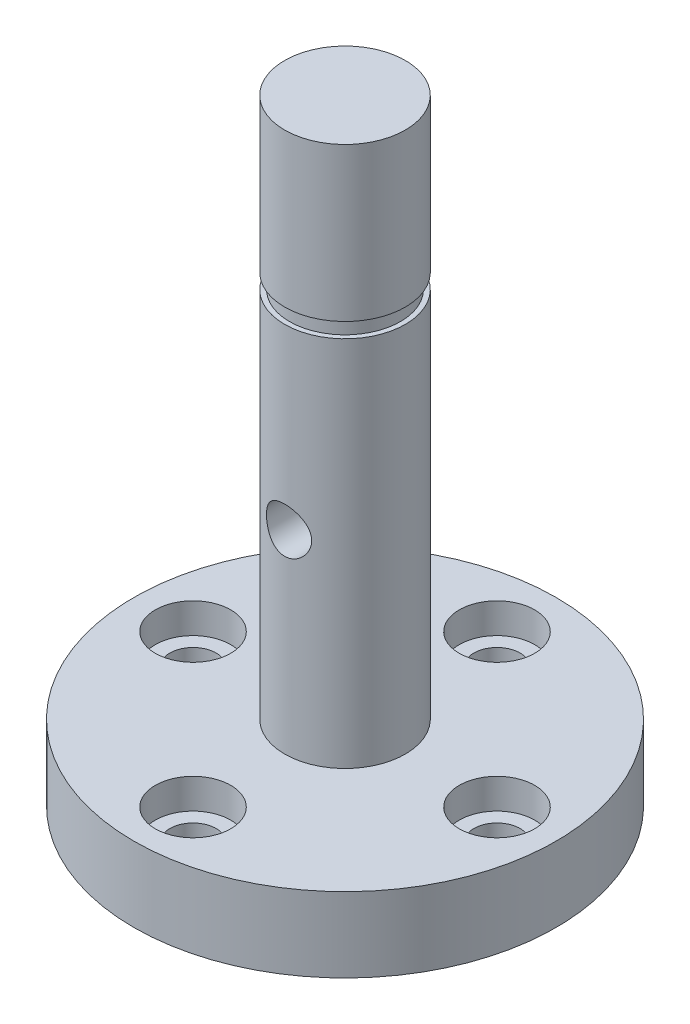
ISO-10303-21;
HEADER;
FILE_DESCRIPTION(('STEP AP214'),'2;1');
FILE_NAME('part.step','',(''),(''),'','','');
FILE_SCHEMA(('AUTOMOTIVE_DESIGN { 1 0 10303 214 1 1 1 1 }'));
ENDSEC;
DATA;
#1=APPLICATION_CONTEXT('core data for automotive mechanical design processes');
#2=APPLICATION_PROTOCOL_DEFINITION('international standard','automotive_design',2000,#1);
#3=PRODUCT_CONTEXT('',#1,'mechanical');
#4=PRODUCT('Part','Part','',(#3));
#5=PRODUCT_RELATED_PRODUCT_CATEGORY('part','',(#4));
#6=PRODUCT_DEFINITION_FORMATION('','',#4);
#7=PRODUCT_DEFINITION_CONTEXT('part definition',#1,'design');
#8=PRODUCT_DEFINITION('design','',#6,#7);
#9=PRODUCT_DEFINITION_SHAPE('','',#8);
#10=(LENGTH_UNIT() NAMED_UNIT(*) SI_UNIT(.MILLI.,.METRE.));
#11=(NAMED_UNIT(*) PLANE_ANGLE_UNIT() SI_UNIT($,.RADIAN.));
#12=(NAMED_UNIT(*) SI_UNIT($,.STERADIAN.) SOLID_ANGLE_UNIT());
#13=UNCERTAINTY_MEASURE_WITH_UNIT(LENGTH_MEASURE(1.E-05),#10,'distance_accuracy_value','');
#14=(GEOMETRIC_REPRESENTATION_CONTEXT(3) GLOBAL_UNCERTAINTY_ASSIGNED_CONTEXT((#13)) GLOBAL_UNIT_ASSIGNED_CONTEXT((#10,
#11,#12)) REPRESENTATION_CONTEXT('',''));
#15=CARTESIAN_POINT('',(0.,0.,0.));
#16=DIRECTION('',(0.,0.,1.));
#17=DIRECTION('',(1.,0.,0.));
#18=AXIS2_PLACEMENT_3D('',#15,#16,#17);
#19=CARTESIAN_POINT('',(0.,32.385,0.));
#20=DIRECTION('',(0.,-1.,0.));
#21=DIRECTION('',(0.,0.,-1.));
#22=AXIS2_PLACEMENT_3D('',#19,#20,#21);
#23=CYLINDRICAL_SURFACE('',#22,3.175);
#24=CARTESIAN_POINT('',(0.,3.937,0.));
#25=DIRECTION('',(0.,1.,0.));
#26=DIRECTION('',(0.,0.,1.));
#27=AXIS2_PLACEMENT_3D('',#24,#25,#26);
#28=CIRCLE('',#27,3.175);
#29=CARTESIAN_POINT('',(0.,3.937,3.175));
#30=VERTEX_POINT('',#29);
#31=EDGE_CURVE('E141',#30,#30,#28,.F.);
#32=ORIENTED_EDGE('',*,*,#31,.F.);
#33=EDGE_LOOP('',(#32));
#34=FACE_BOUND('',#33,.T.);
#35=CARTESIAN_POINT('',(1.190625,14.144625,2.94330377456609));
#36=CARTESIAN_POINT('',(1.19062741384224,14.0803253097966,2.94330152253084));
#37=CARTESIAN_POINT('',(1.18539893054905,14.0160415302627,2.94543369066283));
#38=CARTESIAN_POINT('',(1.16471849142028,13.8894120841876,2.95367201448317));
#39=CARTESIAN_POINT('',(1.14926684177528,13.827066359659,2.95977805115145));
#40=CARTESIAN_POINT('',(1.10878665728393,13.7061770487818,2.97517724972964));
#41=CARTESIAN_POINT('',(1.08378106892664,13.6476247425332,2.984462769706));
#42=CARTESIAN_POINT('',(1.02498411289516,13.5355235569,3.00516237776487));
#43=CARTESIAN_POINT('',(0.99119010625437,13.4819761869632,3.01657710490938));
#44=CARTESIAN_POINT('',(0.913976624657412,13.3787433151494,3.04088462390909));
#45=CARTESIAN_POINT('',(0.870191150880619,13.3293417296067,3.0538209015186));
#46=CARTESIAN_POINT('',(0.775014197824524,13.2383825158545,3.07935114561409));
#47=CARTESIAN_POINT('',(0.723621100266241,13.1968265608424,3.09194503859235));
#48=CARTESIAN_POINT('',(0.612532632547222,13.1213705121154,3.11588843687139));
#49=CARTESIAN_POINT('',(0.552614264608311,13.0877790419443,3.12718101721157));
#50=CARTESIAN_POINT('',(0.427478643997417,13.0312706318084,3.14672668829241));
#51=CARTESIAN_POINT('',(0.362263238303496,13.0083499897314,3.15498083297249));
#52=CARTESIAN_POINT('',(0.231369664955987,12.9748296702289,3.16721090825855));
#53=CARTESIAN_POINT('',(0.165832787842269,12.9637411957191,3.17135601451727));
#54=CARTESIAN_POINT('',(0.0337060887621131,12.9526337967499,3.17550811198177));
#55=CARTESIAN_POINT('',(-0.0328833837686218,12.9526112727652,3.17551644879329));
#56=CARTESIAN_POINT('',(-0.161721437307426,12.963351773163,3.17150167311216));
#57=CARTESIAN_POINT('',(-0.22402179149935,12.9735812552469,3.16767798959867));
#58=CARTESIAN_POINT('',(-0.345947379275108,13.0036378827103,3.15669036977484));
#59=CARTESIAN_POINT('',(-0.405572423097797,13.023465707733,3.14952619693115));
#60=CARTESIAN_POINT('',(-0.521485032484336,13.0724040460177,3.13243729276727));
#61=CARTESIAN_POINT('',(-0.577711405128049,13.1016454416818,3.12247390704374));
#62=CARTESIAN_POINT('',(-0.68459874506631,13.1684649769377,3.10079477491315));
#63=CARTESIAN_POINT('',(-0.735257909190028,13.2060458057702,3.08907846363317));
#64=CARTESIAN_POINT('',(-0.832715573898239,13.2910479084873,3.06429195414304));
#65=CARTESIAN_POINT('',(-0.879114752802885,13.3389162955475,3.05118264987582));
#66=CARTESIAN_POINT('',(-0.963377514831652,13.441833188449,3.02563578137542));
#67=CARTESIAN_POINT('',(-1.00123895424989,13.4968834921031,3.01319838644398));
#68=CARTESIAN_POINT('',(-1.0681145437272,13.6141773272986,2.99015708403391));
#69=CARTESIAN_POINT('',(-1.0969136673239,13.6765533981133,2.97959999988032));
#70=CARTESIAN_POINT('',(-1.14344818650441,13.8057701287268,2.96205623161771));
#71=CARTESIAN_POINT('',(-1.16118973855691,13.8726082812025,2.9550675611334));
#72=CARTESIAN_POINT('',(-1.18419714669549,14.0049059200883,2.94592055295636));
#73=CARTESIAN_POINT('',(-1.19009732419929,14.0702380087693,2.9435169828547));
#74=CARTESIAN_POINT('',(-1.19108446723791,14.2009886769138,2.94311815747981));
#75=CARTESIAN_POINT('',(-1.18617413493173,14.2664072306798,2.94512180059415));
#76=CARTESIAN_POINT('',(-1.16625475981624,14.3922193758158,2.95306259168602));
#77=CARTESIAN_POINT('',(-1.1517361580279,14.4527040890132,2.95880850496806));
#78=CARTESIAN_POINT('',(-1.11362946121006,14.5703511811217,2.9733596159305));
#79=CARTESIAN_POINT('',(-1.09003950802482,14.6275128765897,2.98216544036075));
#80=CARTESIAN_POINT('',(-1.03346481993501,14.739274272723,3.00225017973388));
#81=CARTESIAN_POINT('',(-1.0001610773428,14.793697625634,3.01360942308077));
#82=CARTESIAN_POINT('',(-0.925443585533424,14.896408629245,3.03738608846094));
#83=CARTESIAN_POINT('',(-0.884026868090446,14.9446940236083,3.04980389684049));
#84=CARTESIAN_POINT('',(-0.791152326840116,15.0369336462236,3.0752498070159));
#85=CARTESIAN_POINT('',(-0.739224408558527,15.0804192682102,3.08826669427141));
#86=CARTESIAN_POINT('',(-0.62848924320406,15.1581154542741,3.11268963252121));
#87=CARTESIAN_POINT('',(-0.569681973824869,15.1923259882758,3.12409567829208));
#88=CARTESIAN_POINT('',(-0.4468942115156,15.2502759321084,3.14400394902988));
#89=CARTESIAN_POINT('',(-0.382932331245044,15.2740511795104,3.15251608937045));
#90=CARTESIAN_POINT('',(-0.25152499822158,15.3103710284934,3.16570865390603));
#91=CARTESIAN_POINT('',(-0.184081198324349,15.322920907804,3.17039087868909));
#92=CARTESIAN_POINT('',(-0.0518601208110884,15.3358646821866,3.17522548307927));
#93=CARTESIAN_POINT('',(0.0128434846482983,15.3369244021781,3.1756259588205));
#94=CARTESIAN_POINT('',(0.141467511714863,15.3285704671902,3.17249881286071));
#95=CARTESIAN_POINT('',(0.205388026838425,15.3191580753593,3.16897166491047));
#96=CARTESIAN_POINT('',(0.329047672149346,15.2905945366269,3.15849864872993));
#97=CARTESIAN_POINT('',(0.388850767785889,15.2716865747091,3.15163828156301));
#98=CARTESIAN_POINT('',(0.504440406698824,15.2249108018762,3.13521553249161));
#99=CARTESIAN_POINT('',(0.560226187199963,15.1970412948768,3.12565263914183));
#100=CARTESIAN_POINT('',(0.668766265489316,15.1318008073431,3.10428178275684));
#101=CARTESIAN_POINT('',(0.721294554397188,15.0940796665919,3.09239634336383));
#102=CARTESIAN_POINT('',(0.81948126959667,15.0107587847886,3.06783984232783));
#103=CARTESIAN_POINT('',(0.86513723280937,14.965156231515,3.05516850130009));
#104=CARTESIAN_POINT('',(0.950763387999803,14.8645053455067,3.0296495298047));
#105=CARTESIAN_POINT('',(0.9903063110397,14.80908550579,3.01682789245896));
#106=CARTESIAN_POINT('',(1.05953488210744,14.6919824035262,2.99321795471638));
#107=CARTESIAN_POINT('',(1.08921950747037,14.6302984920325,2.98242986532278));
#108=CARTESIAN_POINT('',(1.13876047785819,14.4994664282258,2.9638805169603));
#109=CARTESIAN_POINT('',(1.15812889801496,14.4301095965813,2.9562726886212));
#110=CARTESIAN_POINT('',(1.1840555814815,14.2887023153851,2.9459872050445));
#111=CARTESIAN_POINT('',(1.19062229600784,14.2166536749114,2.94330629730166));
#112=CARTESIAN_POINT('',(1.190625,14.144625,2.94330377456609));
#113=B_SPLINE_CURVE_WITH_KNOTS('',3,(#35,#36,#37,#38,#39,#40,#41,#42,#43,#44,#45,#46,#47,#48,
#49,#50,#51,#52,#53,#54,#55,#56,#57,#58,#59,#60,#61,#62,#63,#64,#65,#66,#67,#68,#69,#70,#71,#72,
#73,#74,#75,#76,#77,#78,#79,#80,#81,#82,#83,#84,#85,#86,#87,#88,#89,#90,#91,#92,#93,#94,#95,#96,
#97,#98,#99,#100,#101,#102,#103,#104,#105,#106,#107,#108,#109,#110,#111,#112),.UNSPECIFIED.,.T.,
.F.,(4,2,2,2,2,2,2,2,2,2,2,2,2,2,2,2,2,2,2,2,2,2,2,2,2,2,2,2,2,2,2,2,2,2,2,2,2,2,4),(0.,
0.192630854749085,0.385255940337839,0.577421261300891,0.769644351998326,0.970555053433948,
1.17150855378242,1.37929994758284,1.5870191969018,1.78577889676182,1.98447394415105,
2.17333887787535,2.36221718677772,2.55384404148467,2.74553278067999,2.94843735833537,
3.15139282587946,3.35885307600791,3.56619771610657,3.76210240831509,3.95795813839926,
4.14451677705507,4.33111365034686,4.5247048904837,4.71836709095168,4.92430607238688,
5.13024572159828,5.3354724768157,5.5406026916335,5.7337779068651,5.92692982378586,
6.11536967490587,6.30384521163308,6.50024356918607,6.69671215022877,6.90355013386524,
7.11040956744491,7.32633773228796,7.54212330093922),.UNSPECIFIED.);
#114=CARTESIAN_POINT('',(1.190625,14.144625,2.94330377456609));
#115=VERTEX_POINT('',#114);
#116=EDGE_CURVE('E10',#115,#115,#113,.T.);
#117=ORIENTED_EDGE('',*,*,#116,.T.);
#118=EDGE_LOOP('',(#117));
#119=FACE_BOUND('',#118,.T.);
#120=CARTESIAN_POINT('',(0.,15.33525,-3.175));
#121=CARTESIAN_POINT('',(-0.0644803280319207,15.3352523037031,-3.1750017260582));
#122=CARTESIAN_POINT('',(-0.128944879414297,15.3299955653028,-3.17301863556027));
#123=CARTESIAN_POINT('',(-0.255947427804686,15.3091926200045,-3.16530589955499));
#124=CARTESIAN_POINT('',(-0.318485700965169,15.2936478952515,-3.15957679372107));
#125=CARTESIAN_POINT('',(-0.439785748086509,15.2528960548437,-3.14498698210789));
#126=CARTESIAN_POINT('',(-0.498554552928807,15.2277075772727,-3.13613231952368));
#127=CARTESIAN_POINT('',(-0.6110282024397,15.1684780346687,-3.11617334413749));
#128=CARTESIAN_POINT('',(-0.66473168359744,15.1344345952243,-3.10506842811866));
#129=CARTESIAN_POINT('',(-0.767831218530123,15.0569513034625,-3.08122833533403));
#130=CARTESIAN_POINT('',(-0.816983642057507,15.0132016043316,-3.06844702050705));
#131=CARTESIAN_POINT('',(-0.907450095452755,14.9182054674895,-3.04292175316616));
#132=CARTESIAN_POINT('',(-0.948761726101168,14.8669567436052,-3.03017781325932));
#133=CARTESIAN_POINT('',(-1.02392323008938,14.7560367601534,-3.00563336052824));
#134=CARTESIAN_POINT('',(-1.05742893349134,14.6961190340543,-2.99388727501525));
#135=CARTESIAN_POINT('',(-1.11377925527679,14.5709891188787,-2.97338639063463));
#136=CARTESIAN_POINT('',(-1.13662813187983,14.5057790567456,-2.96463039737106));
#137=CARTESIAN_POINT('',(-1.17005442120179,14.3747198374201,-2.95159440179158));
#138=CARTESIAN_POINT('',(-1.1810967711723,14.3090066257419,-2.94714552453478));
#139=CARTESIAN_POINT('',(-1.19205022996995,14.1765209245924,-2.94273336284839));
#140=CARTESIAN_POINT('',(-1.19196593587088,14.1097488839871,-2.94276822592073));
#141=CARTESIAN_POINT('',(-1.18102403502951,13.9812954393622,-2.94717399857943));
#142=CARTESIAN_POINT('',(-1.17081148004021,13.9195485308274,-2.95128528416453));
#143=CARTESIAN_POINT('',(-1.14096933245487,13.7987189493658,-2.96294919584752));
#144=CARTESIAN_POINT('',(-1.12133832170211,13.7396366791252,-2.97050234018473));
#145=CARTESIAN_POINT('',(-1.07286225428948,13.6244988274907,-2.98835526113513));
#146=CARTESIAN_POINT('',(-1.04384989935073,13.5685216578912,-2.99870429903107));
#147=CARTESIAN_POINT('',(-0.977551335491409,13.4620430707872,-3.02096654298085));
#148=CARTESIAN_POINT('',(-0.940262269910612,13.4115435528437,-3.03288028850369));
#149=CARTESIAN_POINT('',(-0.855517884834476,13.3138833419771,-3.05790630844421));
#150=CARTESIAN_POINT('',(-0.807547746065829,13.2671751414062,-3.07104532042939));
#151=CARTESIAN_POINT('',(-0.704304368962593,13.1823317393241,-3.09635309230243));
#152=CARTESIAN_POINT('',(-0.649030010276029,13.1441978554067,-3.10852170288599));
#153=CARTESIAN_POINT('',(-0.531592978112729,13.0770864973316,-3.13075950879707));
#154=CARTESIAN_POINT('',(-0.469337004114241,13.0482597324058,-3.1407933299357));
#155=CARTESIAN_POINT('',(-0.340389250103883,13.0016388078607,-3.15736857672026));
#156=CARTESIAN_POINT('',(-0.273699454858823,12.9838397481046,-3.1639115533356));
#157=CARTESIAN_POINT('',(-0.141585349249249,12.9606494123886,-3.17249526812277));
#158=CARTESIAN_POINT('',(-0.0762822480274997,12.9546488061839,-3.17475686664138));
#159=CARTESIAN_POINT('',(0.054429402233679,12.9534514680294,-3.17520553124475));
#160=CARTESIAN_POINT('',(0.119837924680556,12.9582523407486,-3.17339350069573));
#161=CARTESIAN_POINT('',(0.246270501045979,12.9780585960825,-3.16604419632035));
#162=CARTESIAN_POINT('',(0.307366454105826,12.9926647878413,-3.16065273826329));
#163=CARTESIAN_POINT('',(0.426197517997297,13.0311414450844,-3.1468335994155));
#164=CARTESIAN_POINT('',(0.483932190588358,13.0550131154963,-3.13840552373861));
#165=CARTESIAN_POINT('',(0.596302913556188,13.1121042148738,-3.11903764373597));
#166=CARTESIAN_POINT('',(0.650798072574002,13.1455776975711,-3.1080313141617));
#167=CARTESIAN_POINT('',(0.753580464933011,13.2206349943924,-3.08472420554452));
#168=CARTESIAN_POINT('',(0.801865395464672,13.2622218027077,-3.07242294938803));
#169=CARTESIAN_POINT('',(0.893786946503482,13.3551645219361,-3.04699455283473));
#170=CARTESIAN_POINT('',(0.936991348355826,13.4069472325758,-3.03386090349835));
#171=CARTESIAN_POINT('',(1.01418270962823,13.5172857866117,-3.00893809999065));
#172=CARTESIAN_POINT('',(1.04816884135274,13.5758422375396,-2.99714906660554));
#173=CARTESIAN_POINT('',(1.10599357730705,13.6985501895005,-2.9762992117158));
#174=CARTESIAN_POINT('',(1.12978950323491,13.7627238920664,-2.96724991010742));
#175=CARTESIAN_POINT('',(1.16608132501843,13.8946014999272,-2.95317888607235));
#176=CARTESIAN_POINT('',(1.17858421180018,13.9623031937323,-2.94815467214383));
#177=CARTESIAN_POINT('',(1.1913103800891,14.0946315766358,-2.94303366491605));
#178=CARTESIAN_POINT('',(1.19227069374821,14.1591765264253,-2.94264115340402));
#179=CARTESIAN_POINT('',(1.18377268040514,14.2874565947942,-2.94606990116576));
#180=CARTESIAN_POINT('',(1.17431534131035,14.3511917895831,-2.94989076088501));
#181=CARTESIAN_POINT('',(1.14582428656504,14.4740687362063,-2.96106962383437));
#182=CARTESIAN_POINT('',(1.12709164913741,14.5332913123322,-2.96831611517726));
#183=CARTESIAN_POINT('',(1.08084696819061,14.6477874973674,-2.98546478961414));
#184=CARTESIAN_POINT('',(1.0533327052505,14.7030601036557,-2.99536764396202));
#185=CARTESIAN_POINT('',(0.988632102759094,14.8112375143225,-3.01735905848772));
#186=CARTESIAN_POINT('',(0.951014360373892,14.8638663199599,-3.02953498137515));
#187=CARTESIAN_POINT('',(0.867842480481128,14.9622998640209,-3.0543995836351));
#188=CARTESIAN_POINT('',(0.822285820601664,15.008102424987,-3.06708842498621));
#189=CARTESIAN_POINT('',(0.721582564947792,15.0941103024336,-3.09237399534093));
#190=CARTESIAN_POINT('',(0.666050423844061,15.1338786042888,-3.10492858264887));
#191=CARTESIAN_POINT('',(0.54865049591565,15.2035054826258,-3.12780770850268));
#192=CARTESIAN_POINT('',(0.486782216434428,15.2333632877657,-3.13813207344675));
#193=CARTESIAN_POINT('',(0.355599271339333,15.2831616080571,-3.15574594756552));
#194=CARTESIAN_POINT('',(0.286078153898401,15.3026166075278,-3.16288465369445));
#195=CARTESIAN_POINT('',(0.144363863550065,15.328656286937,-3.17250954730047));
#196=CARTESIAN_POINT('',(0.0721720492396064,15.3352474214931,-3.17499806804399));
#197=CARTESIAN_POINT('',(0.,15.33525,-3.175));
#198=B_SPLINE_CURVE_WITH_KNOTS('',3,(#120,#121,#122,#123,#124,#125,#126,#127,#128,#129,#130,
#131,#132,#133,#134,#135,#136,#137,#138,#139,#140,#141,#142,#143,#144,#145,#146,#147,#148,#149,
#150,#151,#152,#153,#154,#155,#156,#157,#158,#159,#160,#161,#162,#163,#164,#165,#166,#167,#168,
#169,#170,#171,#172,#173,#174,#175,#176,#177,#178,#179,#180,#181,#182,#183,#184,#185,#186,#187,
#188,#189,#190,#191,#192,#193,#194,#195,#196,#197),.UNSPECIFIED.,.T.,.F.,(4,2,2,2,2,2,2,2,2,2,2,
2,2,2,2,2,2,2,2,2,2,2,2,2,2,2,2,2,2,2,2,2,2,2,2,2,2,2,4),(0.,0.193174779988694,
0.386321736189803,0.579097274313273,0.771924557565031,0.972134347500303,1.17240530159712,
1.38030485385691,1.58812126298256,1.78741287818415,1.98662215450767,2.17390936438976,
2.36122478335592,2.55208411657195,2.74300942653255,2.94676634210301,3.15055454712145,
3.35749404133321,3.56434151635958,3.76019234336015,3.95599974284975,4.14428335102047,
4.33259145270721,4.52643257351056,4.72034536640769,4.92550862317927,5.13069029517861,
5.33672309214717,5.54262825746726,5.73531018512449,5.92797384230185,6.1147574430106,
6.30158828783601,6.49821274558139,6.69489978960167,6.90223036662892,7.10957707657798,
7.32590383806682,7.54212202675675),.UNSPECIFIED.);
#199=CARTESIAN_POINT('',(0.,15.33525,-3.175));
#200=VERTEX_POINT('',#199);
#201=EDGE_CURVE('E40',#200,#200,#198,.T.);
#202=ORIENTED_EDGE('',*,*,#201,.T.);
#203=EDGE_LOOP('',(#202));
#204=FACE_BOUND('',#203,.T.);
#205=CARTESIAN_POINT('',(0.,23.52675,0.));
#206=DIRECTION('',(0.,1.,0.));
#207=DIRECTION('',(0.,0.,1.));
#208=AXIS2_PLACEMENT_3D('',#205,#206,#207);
#209=CIRCLE('',#208,3.175);
#210=CARTESIAN_POINT('',(0.,23.52675,3.175));
#211=VERTEX_POINT('',#210);
#212=EDGE_CURVE('E148',#211,#211,#209,.T.);
#213=ORIENTED_EDGE('',*,*,#212,.F.);
#214=EDGE_LOOP('',(#213));
#215=FACE_BOUND('',#214,.T.);
#216=ADVANCED_FACE('F36',(#34,#119,#204,#215),#23,.T.);
#217=CARTESIAN_POINT('',(8.,3.937,0.));
#218=DIRECTION('',(0.,1.,0.));
#219=DIRECTION('',(0.,0.,1.));
#220=AXIS2_PLACEMENT_3D('',#217,#218,#219);
#221=CYLINDRICAL_SURFACE('',#220,1.21919999999999);
#222=CARTESIAN_POINT('',(8.,0.,0.));
#223=DIRECTION('',(0.,1.,0.));
#224=DIRECTION('',(0.,0.,1.));
#225=AXIS2_PLACEMENT_3D('',#222,#223,#224);
#226=CIRCLE('',#225,1.2192);
#227=CARTESIAN_POINT('',(8.,0.,1.2192));
#228=VERTEX_POINT('',#227);
#229=EDGE_CURVE('E194',#228,#228,#226,.T.);
#230=ORIENTED_EDGE('',*,*,#229,.F.);
#231=EDGE_LOOP('',(#230));
#232=FACE_BOUND('',#231,.T.);
#233=CARTESIAN_POINT('',(8.,2.3495,0.));
#234=DIRECTION('',(0.,1.,0.));
#235=DIRECTION('',(0.,0.,1.));
#236=AXIS2_PLACEMENT_3D('',#233,#234,#235);
#237=CIRCLE('',#236,1.21919999999999);
#238=CARTESIAN_POINT('',(8.,2.3495,1.21919999999999));
#239=VERTEX_POINT('',#238);
#240=EDGE_CURVE('E59',#239,#239,#237,.F.);
#241=ORIENTED_EDGE('',*,*,#240,.F.);
#242=EDGE_LOOP('',(#241));
#243=FACE_BOUND('',#242,.T.);
#244=ADVANCED_FACE('F119',(#232,#243),#221,.F.);
#245=CARTESIAN_POINT('',(-8.,3.937,0.));
#246=DIRECTION('',(0.,1.,0.));
#247=DIRECTION('',(0.,0.,1.));
#248=AXIS2_PLACEMENT_3D('',#245,#246,#247);
#249=CYLINDRICAL_SURFACE('',#248,1.21919999999999);
#250=CARTESIAN_POINT('',(-8.,0.,0.));
#251=DIRECTION('',(0.,1.,0.));
#252=DIRECTION('',(0.,0.,1.));
#253=AXIS2_PLACEMENT_3D('',#250,#251,#252);
#254=CIRCLE('',#253,1.2192);
#255=CARTESIAN_POINT('',(-8.,0.,1.2192));
#256=VERTEX_POINT('',#255);
#257=EDGE_CURVE('E191',#256,#256,#254,.T.);
#258=ORIENTED_EDGE('',*,*,#257,.F.);
#259=EDGE_LOOP('',(#258));
#260=FACE_BOUND('',#259,.T.);
#261=CARTESIAN_POINT('',(-8.,2.3495,0.));
#262=DIRECTION('',(0.,1.,0.));
#263=DIRECTION('',(0.,0.,1.));
#264=AXIS2_PLACEMENT_3D('',#261,#262,#263);
#265=CIRCLE('',#264,1.21919999999999);
#266=CARTESIAN_POINT('',(-8.,2.3495,1.21919999999999));
#267=VERTEX_POINT('',#266);
#268=EDGE_CURVE('E206',#267,#267,#265,.F.);
#269=ORIENTED_EDGE('',*,*,#268,.F.);
#270=EDGE_LOOP('',(#269));
#271=FACE_BOUND('',#270,.T.);
#272=ADVANCED_FACE('F115',(#260,#271),#249,.F.);
#273=CARTESIAN_POINT('',(0.,3.937,-8.));
#274=DIRECTION('',(0.,1.,0.));
#275=DIRECTION('',(0.,0.,1.));
#276=AXIS2_PLACEMENT_3D('',#273,#274,#275);
#277=CYLINDRICAL_SURFACE('',#276,1.21919999999999);
#278=CARTESIAN_POINT('',(0.,0.,-8.));
#279=DIRECTION('',(0.,1.,0.));
#280=DIRECTION('',(0.,0.,1.));
#281=AXIS2_PLACEMENT_3D('',#278,#279,#280);
#282=CIRCLE('',#281,1.2192);
#283=CARTESIAN_POINT('',(0.,0.,-6.7808));
#284=VERTEX_POINT('',#283);
#285=EDGE_CURVE('E188',#284,#284,#282,.T.);
#286=ORIENTED_EDGE('',*,*,#285,.F.);
#287=EDGE_LOOP('',(#286));
#288=FACE_BOUND('',#287,.T.);
#289=CARTESIAN_POINT('',(0.,2.3495,-8.));
#290=DIRECTION('',(0.,1.,0.));
#291=DIRECTION('',(0.,0.,1.));
#292=AXIS2_PLACEMENT_3D('',#289,#290,#291);
#293=CIRCLE('',#292,1.21919999999999);
#294=CARTESIAN_POINT('',(0.,2.3495,-6.78080000000001));
#295=VERTEX_POINT('',#294);
#296=EDGE_CURVE('E204',#295,#295,#293,.F.);
#297=ORIENTED_EDGE('',*,*,#296,.F.);
#298=EDGE_LOOP('',(#297));
#299=FACE_BOUND('',#298,.T.);
#300=ADVANCED_FACE('F111',(#288,#299),#277,.F.);
#301=CARTESIAN_POINT('',(0.,3.937,8.));
#302=DIRECTION('',(0.,1.,0.));
#303=DIRECTION('',(0.,0.,1.));
#304=AXIS2_PLACEMENT_3D('',#301,#302,#303);
#305=CYLINDRICAL_SURFACE('',#304,1.21919999999999);
#306=CARTESIAN_POINT('',(0.,0.,8.));
#307=DIRECTION('',(0.,1.,0.));
#308=DIRECTION('',(0.,0.,1.));
#309=AXIS2_PLACEMENT_3D('',#306,#307,#308);
#310=CIRCLE('',#309,1.2192);
#311=CARTESIAN_POINT('',(0.,0.,9.2192));
#312=VERTEX_POINT('',#311);
#313=EDGE_CURVE('E185',#312,#312,#310,.T.);
#314=ORIENTED_EDGE('',*,*,#313,.F.);
#315=EDGE_LOOP('',(#314));
#316=FACE_BOUND('',#315,.T.);
#317=CARTESIAN_POINT('',(0.,2.3495,8.));
#318=DIRECTION('',(0.,1.,0.));
#319=DIRECTION('',(0.,0.,1.));
#320=AXIS2_PLACEMENT_3D('',#317,#318,#319);
#321=CIRCLE('',#320,1.21919999999999);
#322=CARTESIAN_POINT('',(0.,2.3495,9.21919999999999));
#323=VERTEX_POINT('',#322);
#324=EDGE_CURVE('E163',#323,#323,#321,.F.);
#325=ORIENTED_EDGE('',*,*,#324,.F.);
#326=EDGE_LOOP('',(#325));
#327=FACE_BOUND('',#326,.T.);
#328=ADVANCED_FACE('F108',(#316,#327),#305,.F.);
#329=CARTESIAN_POINT('',(0.,3.937,0.));
#330=DIRECTION('',(0.,-1.,0.));
#331=DIRECTION('',(0.,0.,-1.));
#332=AXIS2_PLACEMENT_3D('',#329,#330,#331);
#333=CYLINDRICAL_SURFACE('',#332,11.1125);
#334=CARTESIAN_POINT('',(0.,3.937,0.));
#335=DIRECTION('',(0.,1.,0.));
#336=DIRECTION('',(0.,0.,1.));
#337=AXIS2_PLACEMENT_3D('',#334,#335,#336);
#338=CIRCLE('',#337,11.1125);
#339=CARTESIAN_POINT('',(0.,3.937,11.1125));
#340=VERTEX_POINT('',#339);
#341=EDGE_CURVE('E49',#340,#340,#338,.T.);
#342=ORIENTED_EDGE('',*,*,#341,.F.);
#343=EDGE_LOOP('',(#342));
#344=FACE_BOUND('',#343,.T.);
#345=CARTESIAN_POINT('',(0.,0.,0.));
#346=DIRECTION('',(0.,1.,0.));
#347=DIRECTION('',(0.,0.,1.));
#348=AXIS2_PLACEMENT_3D('',#345,#346,#347);
#349=CIRCLE('',#348,11.1125);
#350=CARTESIAN_POINT('',(0.,0.,11.1125));
#351=VERTEX_POINT('',#350);
#352=EDGE_CURVE('E53',#351,#351,#349,.T.);
#353=ORIENTED_EDGE('',*,*,#352,.T.);
#354=EDGE_LOOP('',(#353));
#355=FACE_BOUND('',#354,.T.);
#356=ADVANCED_FACE('F38',(#344,#355),#333,.T.);
#357=CARTESIAN_POINT('',(0.,3.937,0.));
#358=DIRECTION('',(0.,1.,0.));
#359=DIRECTION('',(0.,0.,1.));
#360=AXIS2_PLACEMENT_3D('',#357,#358,#359);
#361=PLANE('',#360);
#362=CARTESIAN_POINT('',(0.,3.937,8.));
#363=DIRECTION('',(0.,1.,0.));
#364=DIRECTION('',(0.,0.,1.));
#365=AXIS2_PLACEMENT_3D('',#362,#363,#364);
#366=CIRCLE('',#365,1.984375);
#367=CARTESIAN_POINT('',(0.,3.937,9.984375));
#368=VERTEX_POINT('',#367);
#369=EDGE_CURVE('E164',#368,#368,#366,.T.);
#370=ORIENTED_EDGE('',*,*,#369,.F.);
#371=EDGE_LOOP('',(#370));
#372=FACE_BOUND('',#371,.T.);
#373=CARTESIAN_POINT('',(8.,3.937,0.));
#374=DIRECTION('',(0.,1.,0.));
#375=DIRECTION('',(0.,0.,1.));
#376=AXIS2_PLACEMENT_3D('',#373,#374,#375);
#377=CIRCLE('',#376,1.984375);
#378=CARTESIAN_POINT('',(8.,3.937,1.984375));
#379=VERTEX_POINT('',#378);
#380=EDGE_CURVE('E170',#379,#379,#377,.T.);
#381=ORIENTED_EDGE('',*,*,#380,.F.);
#382=EDGE_LOOP('',(#381));
#383=FACE_BOUND('',#382,.T.);
#384=CARTESIAN_POINT('',(0.,3.937,-8.));
#385=DIRECTION('',(0.,1.,0.));
#386=DIRECTION('',(0.,0.,1.));
#387=AXIS2_PLACEMENT_3D('',#384,#385,#386);
#388=CIRCLE('',#387,1.984375);
#389=CARTESIAN_POINT('',(0.,3.937,-6.015625));
#390=VERTEX_POINT('',#389);
#391=EDGE_CURVE('E176',#390,#390,#388,.T.);
#392=ORIENTED_EDGE('',*,*,#391,.F.);
#393=EDGE_LOOP('',(#392));
#394=FACE_BOUND('',#393,.T.);
#395=CARTESIAN_POINT('',(-8.,3.937,0.));
#396=DIRECTION('',(0.,1.,0.));
#397=DIRECTION('',(0.,0.,1.));
#398=AXIS2_PLACEMENT_3D('',#395,#396,#397);
#399=CIRCLE('',#398,1.984375);
#400=CARTESIAN_POINT('',(-8.,3.937,1.984375));
#401=VERTEX_POINT('',#400);
#402=EDGE_CURVE('E182',#401,#401,#399,.T.);
#403=ORIENTED_EDGE('',*,*,#402,.F.);
#404=EDGE_LOOP('',(#403));
#405=FACE_BOUND('',#404,.T.);
#406=ORIENTED_EDGE('',*,*,#31,.T.);
#407=EDGE_LOOP('',(#406));
#408=FACE_BOUND('',#407,.T.);
#409=ORIENTED_EDGE('',*,*,#341,.T.);
#410=EDGE_LOOP('',(#409));
#411=FACE_BOUND('',#410,.T.);
#412=ADVANCED_FACE('F225',(#372,#383,#394,#405,#408,#411),#361,.T.);
#413=CARTESIAN_POINT('',(0.,0.,0.));
#414=DIRECTION('',(0.,1.,0.));
#415=DIRECTION('',(0.,0.,1.));
#416=AXIS2_PLACEMENT_3D('',#413,#414,#415);
#417=PLANE('',#416);
#418=ORIENTED_EDGE('',*,*,#313,.T.);
#419=EDGE_LOOP('',(#418));
#420=FACE_BOUND('',#419,.T.);
#421=ORIENTED_EDGE('',*,*,#285,.T.);
#422=EDGE_LOOP('',(#421));
#423=FACE_BOUND('',#422,.T.);
#424=ORIENTED_EDGE('',*,*,#257,.T.);
#425=EDGE_LOOP('',(#424));
#426=FACE_BOUND('',#425,.T.);
#427=ORIENTED_EDGE('',*,*,#229,.T.);
#428=EDGE_LOOP('',(#427));
#429=FACE_BOUND('',#428,.T.);
#430=ORIENTED_EDGE('',*,*,#352,.F.);
#431=EDGE_LOOP('',(#430));
#432=FACE_BOUND('',#431,.T.);
#433=ADVANCED_FACE('F80',(#420,#423,#426,#429,#432),#417,.F.);
#434=CARTESIAN_POINT('',(0.,2.3495,8.));
#435=DIRECTION('',(0.,1.,0.));
#436=DIRECTION('',(0.,0.,1.));
#437=AXIS2_PLACEMENT_3D('',#434,#435,#436);
#438=PLANE('',#437);
#439=CARTESIAN_POINT('',(0.,2.3495,8.));
#440=DIRECTION('',(0.,1.,0.));
#441=DIRECTION('',(0.,0.,1.));
#442=AXIS2_PLACEMENT_3D('',#439,#440,#441);
#443=CIRCLE('',#442,1.984375);
#444=CARTESIAN_POINT('',(0.,2.3495,9.984375));
#445=VERTEX_POINT('',#444);
#446=EDGE_CURVE('E160',#445,#445,#443,.T.);
#447=ORIENTED_EDGE('',*,*,#446,.T.);
#448=EDGE_LOOP('',(#447));
#449=FACE_BOUND('',#448,.T.);
#450=ORIENTED_EDGE('',*,*,#324,.T.);
#451=EDGE_LOOP('',(#450));
#452=FACE_BOUND('',#451,.T.);
#453=ADVANCED_FACE('F75',(#449,#452),#438,.T.);
#454=CARTESIAN_POINT('',(0.,2.3495,8.));
#455=DIRECTION('',(0.,1.,0.));
#456=DIRECTION('',(0.,0.,1.));
#457=AXIS2_PLACEMENT_3D('',#454,#455,#456);
#458=CYLINDRICAL_SURFACE('',#457,1.984375);
#459=ORIENTED_EDGE('',*,*,#446,.F.);
#460=EDGE_LOOP('',(#459));
#461=FACE_BOUND('',#460,.T.);
#462=ORIENTED_EDGE('',*,*,#369,.T.);
#463=EDGE_LOOP('',(#462));
#464=FACE_BOUND('',#463,.T.);
#465=ADVANCED_FACE('F79',(#461,#464),#458,.F.);
#466=CARTESIAN_POINT('',(0.,2.3495,-8.));
#467=DIRECTION('',(0.,1.,0.));
#468=DIRECTION('',(0.,0.,1.));
#469=AXIS2_PLACEMENT_3D('',#466,#467,#468);
#470=PLANE('',#469);
#471=CARTESIAN_POINT('',(0.,2.3495,-8.));
#472=DIRECTION('',(0.,1.,0.));
#473=DIRECTION('',(0.,0.,1.));
#474=AXIS2_PLACEMENT_3D('',#471,#472,#473);
#475=CIRCLE('',#474,1.984375);
#476=CARTESIAN_POINT('',(0.,2.3495,-6.015625));
#477=VERTEX_POINT('',#476);
#478=EDGE_CURVE('E173',#477,#477,#475,.T.);
#479=ORIENTED_EDGE('',*,*,#478,.T.);
#480=EDGE_LOOP('',(#479));
#481=FACE_BOUND('',#480,.T.);
#482=ORIENTED_EDGE('',*,*,#296,.T.);
#483=EDGE_LOOP('',(#482));
#484=FACE_BOUND('',#483,.T.);
#485=ADVANCED_FACE('F84',(#481,#484),#470,.T.);
#486=CARTESIAN_POINT('',(0.,2.3495,-8.));
#487=DIRECTION('',(0.,1.,0.));
#488=DIRECTION('',(0.,0.,1.));
#489=AXIS2_PLACEMENT_3D('',#486,#487,#488);
#490=CYLINDRICAL_SURFACE('',#489,1.984375);
#491=ORIENTED_EDGE('',*,*,#478,.F.);
#492=EDGE_LOOP('',(#491));
#493=FACE_BOUND('',#492,.T.);
#494=ORIENTED_EDGE('',*,*,#391,.T.);
#495=EDGE_LOOP('',(#494));
#496=FACE_BOUND('',#495,.T.);
#497=ADVANCED_FACE('F96',(#493,#496),#490,.F.);
#498=CARTESIAN_POINT('',(-8.,2.3495,0.));
#499=DIRECTION('',(0.,1.,0.));
#500=DIRECTION('',(0.,0.,1.));
#501=AXIS2_PLACEMENT_3D('',#498,#499,#500);
#502=PLANE('',#501);
#503=CARTESIAN_POINT('',(-8.,2.3495,0.));
#504=DIRECTION('',(0.,1.,0.));
#505=DIRECTION('',(0.,0.,1.));
#506=AXIS2_PLACEMENT_3D('',#503,#504,#505);
#507=CIRCLE('',#506,1.984375);
#508=CARTESIAN_POINT('',(-8.,2.3495,1.984375));
#509=VERTEX_POINT('',#508);
#510=EDGE_CURVE('E179',#509,#509,#507,.T.);
#511=ORIENTED_EDGE('',*,*,#510,.T.);
#512=EDGE_LOOP('',(#511));
#513=FACE_BOUND('',#512,.T.);
#514=ORIENTED_EDGE('',*,*,#268,.T.);
#515=EDGE_LOOP('',(#514));
#516=FACE_BOUND('',#515,.T.);
#517=ADVANCED_FACE('F100',(#513,#516),#502,.T.);
#518=CARTESIAN_POINT('',(-8.,2.3495,0.));
#519=DIRECTION('',(0.,1.,0.));
#520=DIRECTION('',(0.,0.,1.));
#521=AXIS2_PLACEMENT_3D('',#518,#519,#520);
#522=CYLINDRICAL_SURFACE('',#521,1.984375);
#523=ORIENTED_EDGE('',*,*,#510,.F.);
#524=EDGE_LOOP('',(#523));
#525=FACE_BOUND('',#524,.T.);
#526=ORIENTED_EDGE('',*,*,#402,.T.);
#527=EDGE_LOOP('',(#526));
#528=FACE_BOUND('',#527,.T.);
#529=ADVANCED_FACE('F89',(#525,#528),#522,.F.);
#530=CARTESIAN_POINT('',(8.,2.3495,0.));
#531=DIRECTION('',(0.,1.,0.));
#532=DIRECTION('',(0.,0.,1.));
#533=AXIS2_PLACEMENT_3D('',#530,#531,#532);
#534=PLANE('',#533);
#535=CARTESIAN_POINT('',(8.,2.3495,0.));
#536=DIRECTION('',(0.,1.,0.));
#537=DIRECTION('',(0.,0.,1.));
#538=AXIS2_PLACEMENT_3D('',#535,#536,#537);
#539=CIRCLE('',#538,1.984375);
#540=CARTESIAN_POINT('',(8.,2.3495,1.984375));
#541=VERTEX_POINT('',#540);
#542=EDGE_CURVE('E167',#541,#541,#539,.T.);
#543=ORIENTED_EDGE('',*,*,#542,.T.);
#544=EDGE_LOOP('',(#543));
#545=FACE_BOUND('',#544,.T.);
#546=ORIENTED_EDGE('',*,*,#240,.T.);
#547=EDGE_LOOP('',(#546));
#548=FACE_BOUND('',#547,.T.);
#549=ADVANCED_FACE('F86',(#545,#548),#534,.T.);
#550=CARTESIAN_POINT('',(8.,2.3495,0.));
#551=DIRECTION('',(0.,1.,0.));
#552=DIRECTION('',(0.,0.,1.));
#553=AXIS2_PLACEMENT_3D('',#550,#551,#552);
#554=CYLINDRICAL_SURFACE('',#553,1.984375);
#555=ORIENTED_EDGE('',*,*,#542,.F.);
#556=EDGE_LOOP('',(#555));
#557=FACE_BOUND('',#556,.T.);
#558=ORIENTED_EDGE('',*,*,#380,.T.);
#559=EDGE_LOOP('',(#558));
#560=FACE_BOUND('',#559,.T.);
#561=ADVANCED_FACE('F71',(#557,#560),#554,.F.);
#562=CARTESIAN_POINT('',(0.,14.144625,3.175));
#563=DIRECTION('',(0.,0.,1.));
#564=DIRECTION('',(1.,0.,0.));
#565=AXIS2_PLACEMENT_3D('',#562,#563,#564);
#566=CYLINDRICAL_SURFACE('',#565,1.190625);
#567=ORIENTED_EDGE('',*,*,#116,.F.);
#568=EDGE_LOOP('',(#567));
#569=FACE_BOUND('',#568,.T.);
#570=ORIENTED_EDGE('',*,*,#201,.F.);
#571=EDGE_LOOP('',(#570));
#572=FACE_BOUND('',#571,.T.);
#573=ADVANCED_FACE('F65',(#569,#572),#566,.F.);
#574=CARTESIAN_POINT('',(0.,24.31415,0.));
#575=DIRECTION('',(0.,1.,0.));
#576=DIRECTION('',(0.,0.,1.));
#577=AXIS2_PLACEMENT_3D('',#574,#575,#576);
#578=PLANE('',#577);
#579=CARTESIAN_POINT('',(0.,24.31415,0.));
#580=DIRECTION('',(0.,1.,0.));
#581=DIRECTION('',(0.,0.,1.));
#582=AXIS2_PLACEMENT_3D('',#579,#580,#581);
#583=CIRCLE('',#582,3.175);
#584=CARTESIAN_POINT('',(0.,24.31415,3.175));
#585=VERTEX_POINT('',#584);
#586=EDGE_CURVE('E150',#585,#585,#583,.T.);
#587=ORIENTED_EDGE('',*,*,#586,.F.);
#588=EDGE_LOOP('',(#587));
#589=FACE_BOUND('',#588,.T.);
#590=CARTESIAN_POINT('',(0.,24.31415,0.));
#591=DIRECTION('',(0.,1.,0.));
#592=DIRECTION('',(0.,0.,1.));
#593=AXIS2_PLACEMENT_3D('',#590,#591,#592);
#594=CIRCLE('',#593,2.921);
#595=CARTESIAN_POINT('',(0.,24.31415,2.921));
#596=VERTEX_POINT('',#595);
#597=EDGE_CURVE('E151',#596,#596,#594,.T.);
#598=ORIENTED_EDGE('',*,*,#597,.T.);
#599=EDGE_LOOP('',(#598));
#600=FACE_BOUND('',#599,.T.);
#601=ADVANCED_FACE('F70',(#589,#600),#578,.F.);
#602=CARTESIAN_POINT('',(0.,23.52675,0.));
#603=DIRECTION('',(0.,1.,0.));
#604=DIRECTION('',(0.,0.,1.));
#605=AXIS2_PLACEMENT_3D('',#602,#603,#604);
#606=PLANE('',#605);
#607=ORIENTED_EDGE('',*,*,#212,.T.);
#608=EDGE_LOOP('',(#607));
#609=FACE_BOUND('',#608,.T.);
#610=CARTESIAN_POINT('',(0.,23.52675,0.));
#611=DIRECTION('',(0.,1.,0.));
#612=DIRECTION('',(0.,0.,1.));
#613=AXIS2_PLACEMENT_3D('',#610,#611,#612);
#614=CIRCLE('',#613,2.921);
#615=CARTESIAN_POINT('',(0.,23.52675,2.921));
#616=VERTEX_POINT('',#615);
#617=EDGE_CURVE('E156',#616,#616,#614,.T.);
#618=ORIENTED_EDGE('',*,*,#617,.F.);
#619=EDGE_LOOP('',(#618));
#620=FACE_BOUND('',#619,.T.);
#621=ADVANCED_FACE('F73',(#609,#620),#606,.T.);
#622=CARTESIAN_POINT('',(0.,24.31415,0.));
#623=DIRECTION('',(0.,-1.,0.));
#624=DIRECTION('',(0.,0.,-1.));
#625=AXIS2_PLACEMENT_3D('',#622,#623,#624);
#626=CYLINDRICAL_SURFACE('',#625,2.921);
#627=ORIENTED_EDGE('',*,*,#597,.F.);
#628=EDGE_LOOP('',(#627));
#629=FACE_BOUND('',#628,.T.);
#630=ORIENTED_EDGE('',*,*,#617,.T.);
#631=EDGE_LOOP('',(#630));
#632=FACE_BOUND('',#631,.T.);
#633=ADVANCED_FACE('F125',(#629,#632),#626,.T.);
#634=CARTESIAN_POINT('',(0.,32.385,0.));
#635=DIRECTION('',(0.,1.,0.));
#636=DIRECTION('',(0.,0.,1.));
#637=AXIS2_PLACEMENT_3D('',#634,#635,#636);
#638=PLANE('',#637);
#639=CARTESIAN_POINT('',(0.,32.385,0.));
#640=DIRECTION('',(0.,1.,0.));
#641=DIRECTION('',(0.,0.,1.));
#642=AXIS2_PLACEMENT_3D('',#639,#640,#641);
#643=CIRCLE('',#642,3.175);
#644=CARTESIAN_POINT('',(0.,32.385,3.175));
#645=VERTEX_POINT('',#644);
#646=EDGE_CURVE('E197',#645,#645,#643,.T.);
#647=ORIENTED_EDGE('',*,*,#646,.T.);
#648=EDGE_LOOP('',(#647));
#649=FACE_BOUND('',#648,.T.);
#650=ADVANCED_FACE('F123',(#649),#638,.T.);
#651=ORIENTED_EDGE('',*,*,#586,.T.);
#652=EDGE_LOOP('',(#651));
#653=FACE_BOUND('',#652,.T.);
#654=ORIENTED_EDGE('',*,*,#646,.F.);
#655=EDGE_LOOP('',(#654));
#656=FACE_BOUND('',#655,.T.);
#657=ADVANCED_FACE('F61',(#653,#656),#23,.T.);
#658=CLOSED_SHELL('',(#216,#244,#272,#300,#328,#356,#412,#433,#453,#465,#485,#497,#517,#529,
#549,#561,#573,#601,#621,#633,#650,#657));
#659=MANIFOLD_SOLID_BREP('B2',#658);
#660=ADVANCED_BREP_SHAPE_REPRESENTATION('',(#18,#659),#14);
#661=SHAPE_DEFINITION_REPRESENTATION(#9,#660);
ENDSEC;
END-ISO-10303-21;
